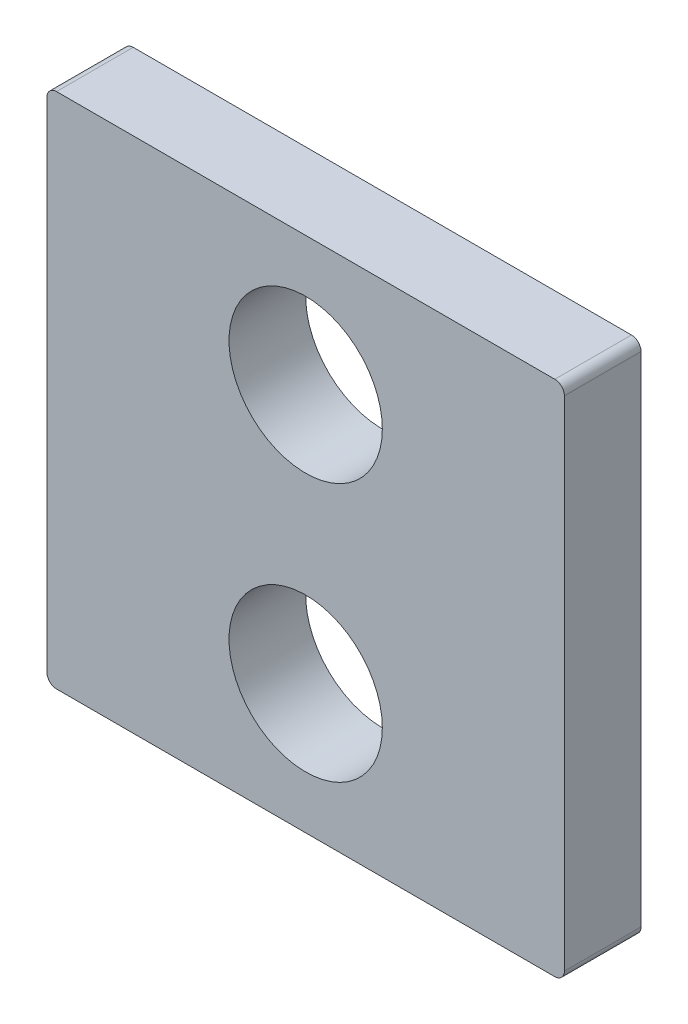
ISO-10303-21;
HEADER;
FILE_DESCRIPTION(('STEP AP214'),'2;1');
FILE_NAME('part.step','',(''),(''),'','','');
FILE_SCHEMA(('AUTOMOTIVE_DESIGN { 1 0 10303 214 1 1 1 1 }'));
ENDSEC;
DATA;
#1=APPLICATION_CONTEXT('core data for automotive mechanical design processes');
#2=APPLICATION_PROTOCOL_DEFINITION('international standard','automotive_design',2000,#1);
#3=PRODUCT_CONTEXT('',#1,'mechanical');
#4=PRODUCT('Part','Part','',(#3));
#5=PRODUCT_RELATED_PRODUCT_CATEGORY('part','',(#4));
#6=PRODUCT_DEFINITION_FORMATION('','',#4);
#7=PRODUCT_DEFINITION_CONTEXT('part definition',#1,'design');
#8=PRODUCT_DEFINITION('design','',#6,#7);
#9=PRODUCT_DEFINITION_SHAPE('','',#8);
#10=(LENGTH_UNIT() NAMED_UNIT(*) SI_UNIT(.MILLI.,.METRE.));
#11=(NAMED_UNIT(*) PLANE_ANGLE_UNIT() SI_UNIT($,.RADIAN.));
#12=(NAMED_UNIT(*) SI_UNIT($,.STERADIAN.) SOLID_ANGLE_UNIT());
#13=UNCERTAINTY_MEASURE_WITH_UNIT(LENGTH_MEASURE(1.E-05),#10,'distance_accuracy_value','');
#14=(GEOMETRIC_REPRESENTATION_CONTEXT(3) GLOBAL_UNCERTAINTY_ASSIGNED_CONTEXT((#13)) GLOBAL_UNIT_ASSIGNED_CONTEXT((#10,
#11,#12)) REPRESENTATION_CONTEXT('',''));
#15=CARTESIAN_POINT('',(0.,0.,0.));
#16=DIRECTION('',(0.,0.,1.));
#17=DIRECTION('',(1.,0.,0.));
#18=AXIS2_PLACEMENT_3D('',#15,#16,#17);
#19=CARTESIAN_POINT('',(151.652465963196,69.0432096796362,-12.700000000002));
#20=DIRECTION('',(0.,0.,1.00000000000001));
#21=DIRECTION('',(1.,0.,0.));
#22=AXIS2_PLACEMENT_3D('',#19,#20,#21);
#23=CYLINDRICAL_SURFACE('',#22,1.58750000000001);
#24=CARTESIAN_POINT('',(151.652465963196,69.0432096796366,-1.4432899320127E-12));
#25=DIRECTION('',(0.,0.,1.00000000000001));
#26=DIRECTION('',(1.,0.,0.));
#27=AXIS2_PLACEMENT_3D('',#24,#25,#26);
#28=CIRCLE('',#27,1.58750000000001);
#29=CARTESIAN_POINT('',(151.652465963196,70.6307096796363,-2.22044604925031E-13));
#30=VERTEX_POINT('',#29);
#31=CARTESIAN_POINT('',(150.064965963196,69.0432096796361,-1.0547118733939E-12));
#32=VERTEX_POINT('',#31);
#33=EDGE_CURVE('E230',#30,#32,#28,.T.);
#34=ORIENTED_EDGE('',*,*,#33,.F.);
#35=DIRECTION('',(0.,0.,1.00000000000001));
#36=VECTOR('',#35,1.);
#37=CARTESIAN_POINT('',(151.652465963196,70.6307096796364,-12.700000000001));
#38=LINE('',#37,#36);
#39=CARTESIAN_POINT('',(151.652465963196,70.6307096796364,-12.700000000001));
#40=VERTEX_POINT('',#39);
#41=EDGE_CURVE('E12',#40,#30,#38,.T.);
#42=ORIENTED_EDGE('',*,*,#41,.F.);
#43=CARTESIAN_POINT('',(151.652465963196,69.0432096796362,-12.700000000002));
#44=DIRECTION('',(0.,0.,1.00000000000001));
#45=DIRECTION('',(1.,0.,0.));
#46=AXIS2_PLACEMENT_3D('',#43,#44,#45);
#47=CIRCLE('',#46,1.58750000000001);
#48=CARTESIAN_POINT('',(150.064965963196,69.0432096796362,-12.7000000000018));
#49=VERTEX_POINT('',#48);
#50=EDGE_CURVE('E177',#40,#49,#47,.T.);
#51=ORIENTED_EDGE('',*,*,#50,.T.);
#52=DIRECTION('',(0.,0.,1.00000000000001));
#53=VECTOR('',#52,1.);
#54=CARTESIAN_POINT('',(150.064965963196,69.0432096796362,-12.7000000000018));
#55=LINE('',#54,#53);
#56=EDGE_CURVE('E46',#49,#32,#55,.T.);
#57=ORIENTED_EDGE('',*,*,#56,.T.);
#58=EDGE_LOOP('',(#34,#42,#51,#57));
#59=FACE_BOUND('',#58,.T.);
#60=ADVANCED_FACE('F43',(#59),#23,.T.);
#61=CARTESIAN_POINT('',(234.202465963196,70.6307096796363,-12.7000000000004));
#62=DIRECTION('',(0.,1.00000000000001,0.));
#63=DIRECTION('',(-1.,0.,0.));
#64=AXIS2_PLACEMENT_3D('',#61,#62,#63);
#65=PLANE('',#64);
#66=DIRECTION('',(-1.,0.,0.));
#67=VECTOR('',#66,1.);
#68=CARTESIAN_POINT('',(234.202465963196,70.6307096796358,-7.21644966006352E-13));
#69=LINE('',#68,#67);
#70=CARTESIAN_POINT('',(234.202465963196,70.6307096796358,-7.21644966006352E-13));
#71=VERTEX_POINT('',#70);
#72=EDGE_CURVE('E187',#71,#30,#69,.T.);
#73=ORIENTED_EDGE('',*,*,#72,.F.);
#74=DIRECTION('',(0.,0.,1.00000000000001));
#75=VECTOR('',#74,1.);
#76=CARTESIAN_POINT('',(234.202465963196,70.6307096796363,-12.7000000000004));
#77=LINE('',#76,#75);
#78=CARTESIAN_POINT('',(234.202465963196,70.6307096796363,-12.7000000000004));
#79=VERTEX_POINT('',#78);
#80=EDGE_CURVE('E54',#79,#71,#77,.T.);
#81=ORIENTED_EDGE('',*,*,#80,.F.);
#82=DIRECTION('',(-1.,0.,0.));
#83=VECTOR('',#82,1.);
#84=CARTESIAN_POINT('',(234.202465963196,70.6307096796363,-12.7000000000004));
#85=LINE('',#84,#83);
#86=EDGE_CURVE('E133',#79,#40,#85,.T.);
#87=ORIENTED_EDGE('',*,*,#86,.T.);
#88=ORIENTED_EDGE('',*,*,#41,.T.);
#89=EDGE_LOOP('',(#73,#81,#87,#88));
#90=FACE_BOUND('',#89,.T.);
#91=ADVANCED_FACE('F333',(#90),#65,.T.);
#92=CARTESIAN_POINT('',(234.202465963196,69.0432096796356,-12.7000000000009));
#93=DIRECTION('',(0.,0.,1.00000000000001));
#94=DIRECTION('',(1.,0.,0.));
#95=AXIS2_PLACEMENT_3D('',#92,#93,#94);
#96=CYLINDRICAL_SURFACE('',#95,1.58750000000001);
#97=CARTESIAN_POINT('',(234.202465963196,69.0432096796362,-9.43689570931383E-13));
#98=DIRECTION('',(0.,0.,1.00000000000001));
#99=DIRECTION('',(1.,0.,0.));
#100=AXIS2_PLACEMENT_3D('',#97,#98,#99);
#101=CIRCLE('',#100,1.58750000000001);
#102=CARTESIAN_POINT('',(235.789965963196,69.0432096796361,-1.27675647831893E-12));
#103=VERTEX_POINT('',#102);
#104=EDGE_CURVE('E119',#103,#71,#101,.T.);
#105=ORIENTED_EDGE('',*,*,#104,.F.);
#106=DIRECTION('',(0.,0.,1.00000000000001));
#107=VECTOR('',#106,1.);
#108=CARTESIAN_POINT('',(235.789965963196,69.043209679636,-12.7000000000004));
#109=LINE('',#108,#107);
#110=CARTESIAN_POINT('',(235.789965963196,69.043209679636,-12.7000000000004));
#111=VERTEX_POINT('',#110);
#112=EDGE_CURVE('E114',#111,#103,#109,.T.);
#113=ORIENTED_EDGE('',*,*,#112,.F.);
#114=CARTESIAN_POINT('',(234.202465963196,69.0432096796356,-12.7000000000009));
#115=DIRECTION('',(0.,0.,1.00000000000001));
#116=DIRECTION('',(1.,0.,0.));
#117=AXIS2_PLACEMENT_3D('',#114,#115,#116);
#118=CIRCLE('',#117,1.58750000000001);
#119=EDGE_CURVE('E117',#111,#79,#118,.T.);
#120=ORIENTED_EDGE('',*,*,#119,.T.);
#121=ORIENTED_EDGE('',*,*,#80,.T.);
#122=EDGE_LOOP('',(#105,#113,#120,#121));
#123=FACE_BOUND('',#122,.T.);
#124=ADVANCED_FACE('F116',(#123),#96,.T.);
#125=CARTESIAN_POINT('',(235.789965963196,-13.5067903203646,-12.700000000001));
#126=DIRECTION('',(1.,0.,0.));
#127=DIRECTION('',(0.,1.00000000000001,0.));
#128=AXIS2_PLACEMENT_3D('',#125,#126,#127);
#129=PLANE('',#128);
#130=DIRECTION('',(0.,1.00000000000001,0.));
#131=VECTOR('',#130,1.);
#132=CARTESIAN_POINT('',(235.789965963196,-13.5067903203639,-8.88178419700125E-13));
#133=LINE('',#132,#131);
#134=CARTESIAN_POINT('',(235.789965963196,-13.5067903203639,-8.88178419700125E-13));
#135=VERTEX_POINT('',#134);
#136=EDGE_CURVE('E201',#135,#103,#133,.T.);
#137=ORIENTED_EDGE('',*,*,#136,.F.);
#138=DIRECTION('',(0.,0.,1.00000000000001));
#139=VECTOR('',#138,1.);
#140=CARTESIAN_POINT('',(235.789965963196,-13.5067903203646,-12.700000000001));
#141=LINE('',#140,#139);
#142=CARTESIAN_POINT('',(235.789965963196,-13.5067903203646,-12.700000000001));
#143=VERTEX_POINT('',#142);
#144=EDGE_CURVE('E125',#143,#135,#141,.T.);
#145=ORIENTED_EDGE('',*,*,#144,.F.);
#146=DIRECTION('',(0.,1.00000000000001,0.));
#147=VECTOR('',#146,1.);
#148=CARTESIAN_POINT('',(235.789965963196,-13.5067903203646,-12.700000000001));
#149=LINE('',#148,#147);
#150=EDGE_CURVE('E131',#143,#111,#149,.T.);
#151=ORIENTED_EDGE('',*,*,#150,.T.);
#152=ORIENTED_EDGE('',*,*,#112,.T.);
#153=EDGE_LOOP('',(#137,#145,#151,#152));
#154=FACE_BOUND('',#153,.T.);
#155=ADVANCED_FACE('F136',(#154),#129,.T.);
#156=CARTESIAN_POINT('',(234.202465963196,-13.5067903203643,-12.7000000000012));
#157=DIRECTION('',(0.,0.,1.00000000000001));
#158=DIRECTION('',(1.,0.,0.));
#159=AXIS2_PLACEMENT_3D('',#156,#157,#158);
#160=CYLINDRICAL_SURFACE('',#159,1.5875);
#161=CARTESIAN_POINT('',(234.202465963196,-13.506790320364,-9.99200722162641E-13));
#162=DIRECTION('',(0.,0.,1.00000000000001));
#163=DIRECTION('',(1.,0.,0.));
#164=AXIS2_PLACEMENT_3D('',#161,#162,#163);
#165=CIRCLE('',#164,1.5875);
#166=CARTESIAN_POINT('',(234.202465963196,-15.0942903203641,0.));
#167=VERTEX_POINT('',#166);
#168=EDGE_CURVE('E204',#167,#135,#165,.T.);
#169=ORIENTED_EDGE('',*,*,#168,.F.);
#170=DIRECTION('',(0.,0.,1.00000000000001));
#171=VECTOR('',#170,1.);
#172=CARTESIAN_POINT('',(234.202465963196,-15.0942903203646,-12.7000000000012));
#173=LINE('',#172,#171);
#174=CARTESIAN_POINT('',(234.202465963196,-15.0942903203646,-12.7000000000012));
#175=VERTEX_POINT('',#174);
#176=EDGE_CURVE('E289',#175,#167,#173,.T.);
#177=ORIENTED_EDGE('',*,*,#176,.F.);
#178=CARTESIAN_POINT('',(234.202465963196,-13.5067903203643,-12.7000000000012));
#179=DIRECTION('',(0.,0.,1.00000000000001));
#180=DIRECTION('',(1.,0.,0.));
#181=AXIS2_PLACEMENT_3D('',#178,#179,#180);
#182=CIRCLE('',#181,1.5875);
#183=EDGE_CURVE('E138',#175,#143,#182,.T.);
#184=ORIENTED_EDGE('',*,*,#183,.T.);
#185=ORIENTED_EDGE('',*,*,#144,.T.);
#186=EDGE_LOOP('',(#169,#177,#184,#185));
#187=FACE_BOUND('',#186,.T.);
#188=ADVANCED_FACE('F332',(#187),#160,.T.);
#189=CARTESIAN_POINT('',(151.652465963196,-15.0942903203642,-12.7000000000011));
#190=DIRECTION('',(0.,-1.00000000000001,0.));
#191=DIRECTION('',(1.,0.,0.));
#192=AXIS2_PLACEMENT_3D('',#189,#190,#191);
#193=PLANE('',#192);
#194=DIRECTION('',(1.,0.,0.));
#195=VECTOR('',#194,1.);
#196=CARTESIAN_POINT('',(151.652465963196,-15.0942903203641,0.));
#197=LINE('',#196,#195);
#198=CARTESIAN_POINT('',(151.652465963196,-15.0942903203641,0.));
#199=VERTEX_POINT('',#198);
#200=EDGE_CURVE('E213',#199,#167,#197,.T.);
#201=ORIENTED_EDGE('',*,*,#200,.F.);
#202=DIRECTION('',(0.,0.,1.00000000000001));
#203=VECTOR('',#202,1.);
#204=CARTESIAN_POINT('',(151.652465963196,-15.0942903203642,-12.7000000000011));
#205=LINE('',#204,#203);
#206=CARTESIAN_POINT('',(151.652465963196,-15.0942903203642,-12.7000000000011));
#207=VERTEX_POINT('',#206);
#208=EDGE_CURVE('E293',#207,#199,#205,.T.);
#209=ORIENTED_EDGE('',*,*,#208,.F.);
#210=DIRECTION('',(1.,0.,0.));
#211=VECTOR('',#210,1.);
#212=CARTESIAN_POINT('',(151.652465963196,-15.0942903203642,-12.7000000000011));
#213=LINE('',#212,#211);
#214=EDGE_CURVE('E142',#207,#175,#213,.T.);
#215=ORIENTED_EDGE('',*,*,#214,.T.);
#216=ORIENTED_EDGE('',*,*,#176,.T.);
#217=EDGE_LOOP('',(#201,#209,#215,#216));
#218=FACE_BOUND('',#217,.T.);
#219=ADVANCED_FACE('F329',(#218),#193,.T.);
#220=CARTESIAN_POINT('',(151.652465963196,-13.5067903203646,-12.7000000000014));
#221=DIRECTION('',(0.,0.,1.00000000000001));
#222=DIRECTION('',(1.,0.,0.));
#223=AXIS2_PLACEMENT_3D('',#220,#221,#222);
#224=CYLINDRICAL_SURFACE('',#223,1.58750000000001);
#225=CARTESIAN_POINT('',(151.652465963196,-13.5067903203639,-8.88178419700125E-13));
#226=DIRECTION('',(0.,0.,1.00000000000001));
#227=DIRECTION('',(1.,0.,0.));
#228=AXIS2_PLACEMENT_3D('',#225,#226,#227);
#229=CIRCLE('',#228,1.58750000000001);
#230=CARTESIAN_POINT('',(150.064965963196,-13.5067903203644,-1.11022302462516E-12));
#231=VERTEX_POINT('',#230);
#232=EDGE_CURVE('E217',#231,#199,#229,.T.);
#233=ORIENTED_EDGE('',*,*,#232,.F.);
#234=DIRECTION('',(0.,0.,1.00000000000001));
#235=VECTOR('',#234,1.);
#236=CARTESIAN_POINT('',(150.064965963196,-13.5067903203646,-12.7000000000012));
#237=LINE('',#236,#235);
#238=CARTESIAN_POINT('',(150.064965963196,-13.5067903203646,-12.7000000000012));
#239=VERTEX_POINT('',#238);
#240=EDGE_CURVE('E297',#239,#231,#237,.T.);
#241=ORIENTED_EDGE('',*,*,#240,.F.);
#242=CARTESIAN_POINT('',(151.652465963196,-13.5067903203646,-12.7000000000014));
#243=DIRECTION('',(0.,0.,1.00000000000001));
#244=DIRECTION('',(1.,0.,0.));
#245=AXIS2_PLACEMENT_3D('',#242,#243,#244);
#246=CIRCLE('',#245,1.58750000000001);
#247=EDGE_CURVE('E164',#239,#207,#246,.T.);
#248=ORIENTED_EDGE('',*,*,#247,.T.);
#249=ORIENTED_EDGE('',*,*,#208,.T.);
#250=EDGE_LOOP('',(#233,#241,#248,#249));
#251=FACE_BOUND('',#250,.T.);
#252=ADVANCED_FACE('F325',(#251),#224,.T.);
#253=CARTESIAN_POINT('',(150.064965963196,69.0432096796362,-12.7000000000018));
#254=DIRECTION('',(-1.,0.,0.));
#255=DIRECTION('',(0.,0.,1.00000000000001));
#256=AXIS2_PLACEMENT_3D('',#253,#254,#255);
#257=PLANE('',#256);
#258=DIRECTION('',(0.,-1.00000000000001,0.));
#259=VECTOR('',#258,1.);
#260=CARTESIAN_POINT('',(150.064965963196,69.0432096796361,-1.0547118733939E-12));
#261=LINE('',#260,#259);
#262=EDGE_CURVE('E226',#32,#231,#261,.T.);
#263=ORIENTED_EDGE('',*,*,#262,.F.);
#264=ORIENTED_EDGE('',*,*,#56,.F.);
#265=DIRECTION('',(0.,-1.00000000000001,0.));
#266=VECTOR('',#265,1.);
#267=CARTESIAN_POINT('',(150.064965963196,69.0432096796362,-12.7000000000018));
#268=LINE('',#267,#266);
#269=EDGE_CURVE('E174',#49,#239,#268,.T.);
#270=ORIENTED_EDGE('',*,*,#269,.T.);
#271=ORIENTED_EDGE('',*,*,#240,.T.);
#272=EDGE_LOOP('',(#263,#264,#270,#271));
#273=FACE_BOUND('',#272,.T.);
#274=ADVANCED_FACE('F350',(#273),#257,.T.);
#275=CARTESIAN_POINT('',(151.652465963196,69.0432096796362,-12.700000000002));
#276=DIRECTION('',(0.,0.,1.00000000000001));
#277=DIRECTION('',(1.,0.,0.));
#278=AXIS2_PLACEMENT_3D('',#275,#276,#277);
#279=PLANE('',#278);
#280=CARTESIAN_POINT('',(192.927465963196,49.1994596796365,-12.7000000000011));
#281=DIRECTION('',(0.,0.,1.00000000000001));
#282=DIRECTION('',(1.,0.,0.));
#283=AXIS2_PLACEMENT_3D('',#280,#281,#282);
#284=CIRCLE('',#283,12.7);
#285=CARTESIAN_POINT('',(205.627465963196,49.1994596796365,-12.7000000000011));
#286=VERTEX_POINT('',#285);
#287=EDGE_CURVE('E249',#286,#286,#284,.T.);
#288=ORIENTED_EDGE('',*,*,#287,.T.);
#289=EDGE_LOOP('',(#288));
#290=FACE_BOUND('',#289,.T.);
#291=CARTESIAN_POINT('',(192.927465963196,6.33695967963549,-12.7000000000018));
#292=DIRECTION('',(0.,0.,1.00000000000001));
#293=DIRECTION('',(1.,0.,0.));
#294=AXIS2_PLACEMENT_3D('',#291,#292,#293);
#295=CIRCLE('',#294,12.7);
#296=CARTESIAN_POINT('',(205.627465963196,6.33695967963549,-12.7000000000018));
#297=VERTEX_POINT('',#296);
#298=EDGE_CURVE('E237',#297,#297,#295,.T.);
#299=ORIENTED_EDGE('',*,*,#298,.T.);
#300=EDGE_LOOP('',(#299));
#301=FACE_BOUND('',#300,.T.);
#302=ORIENTED_EDGE('',*,*,#50,.F.);
#303=ORIENTED_EDGE('',*,*,#86,.F.);
#304=ORIENTED_EDGE('',*,*,#119,.F.);
#305=ORIENTED_EDGE('',*,*,#150,.F.);
#306=ORIENTED_EDGE('',*,*,#183,.F.);
#307=ORIENTED_EDGE('',*,*,#214,.F.);
#308=ORIENTED_EDGE('',*,*,#247,.F.);
#309=ORIENTED_EDGE('',*,*,#269,.F.);
#310=EDGE_LOOP('',(#302,#303,#304,#305,#306,#307,#308,#309));
#311=FACE_BOUND('',#310,.T.);
#312=ADVANCED_FACE('F129',(#290,#301,#311),#279,.F.);
#313=CARTESIAN_POINT('',(151.652465963196,69.0432096796366,-1.4432899320127E-12));
#314=DIRECTION('',(0.,0.,1.00000000000001));
#315=DIRECTION('',(1.,0.,0.));
#316=AXIS2_PLACEMENT_3D('',#313,#314,#315);
#317=PLANE('',#316);
#318=CARTESIAN_POINT('',(192.927465963196,49.1994596796365,-7.7715611723761E-13));
#319=DIRECTION('',(0.,0.,1.00000000000001));
#320=DIRECTION('',(1.,0.,0.));
#321=AXIS2_PLACEMENT_3D('',#318,#319,#320);
#322=CIRCLE('',#321,12.7);
#323=CARTESIAN_POINT('',(205.627465963196,49.1994596796365,-7.78566100478884E-13));
#324=VERTEX_POINT('',#323);
#325=EDGE_CURVE('E253',#324,#324,#322,.T.);
#326=ORIENTED_EDGE('',*,*,#325,.F.);
#327=EDGE_LOOP('',(#326));
#328=FACE_BOUND('',#327,.T.);
#329=CARTESIAN_POINT('',(192.927465963196,6.33695967963568,-9.43689570931383E-13));
#330=DIRECTION('',(0.,0.,1.00000000000001));
#331=DIRECTION('',(1.,0.,0.));
#332=AXIS2_PLACEMENT_3D('',#329,#330,#331);
#333=CIRCLE('',#332,12.7);
#334=CARTESIAN_POINT('',(205.627465963196,6.33695967963568,-9.45099554172657E-13));
#335=VERTEX_POINT('',#334);
#336=EDGE_CURVE('E241',#335,#335,#333,.T.);
#337=ORIENTED_EDGE('',*,*,#336,.F.);
#338=EDGE_LOOP('',(#337));
#339=FACE_BOUND('',#338,.T.);
#340=ORIENTED_EDGE('',*,*,#33,.T.);
#341=ORIENTED_EDGE('',*,*,#262,.T.);
#342=ORIENTED_EDGE('',*,*,#232,.T.);
#343=ORIENTED_EDGE('',*,*,#200,.T.);
#344=ORIENTED_EDGE('',*,*,#168,.T.);
#345=ORIENTED_EDGE('',*,*,#136,.T.);
#346=ORIENTED_EDGE('',*,*,#104,.T.);
#347=ORIENTED_EDGE('',*,*,#72,.T.);
#348=EDGE_LOOP('',(#340,#341,#342,#343,#344,#345,#346,#347));
#349=FACE_BOUND('',#348,.T.);
#350=ADVANCED_FACE('F264',(#328,#339,#349),#317,.T.);
#351=CARTESIAN_POINT('',(192.927465963196,6.33695967963568,-9.43689570931383E-13));
#352=DIRECTION('',(0.,0.,1.00000000000001));
#353=DIRECTION('',(1.,0.,0.));
#354=AXIS2_PLACEMENT_3D('',#351,#352,#353);
#355=CYLINDRICAL_SURFACE('',#354,12.7);
#356=ORIENTED_EDGE('',*,*,#298,.F.);
#357=EDGE_LOOP('',(#356));
#358=FACE_BOUND('',#357,.T.);
#359=ORIENTED_EDGE('',*,*,#336,.T.);
#360=EDGE_LOOP('',(#359));
#361=FACE_BOUND('',#360,.T.);
#362=ADVANCED_FACE('F267',(#358,#361),#355,.F.);
#363=CARTESIAN_POINT('',(192.927465963196,49.1994596796365,-7.7715611723761E-13));
#364=DIRECTION('',(0.,0.,1.00000000000001));
#365=DIRECTION('',(1.,0.,0.));
#366=AXIS2_PLACEMENT_3D('',#363,#364,#365);
#367=CYLINDRICAL_SURFACE('',#366,12.7);
#368=ORIENTED_EDGE('',*,*,#287,.F.);
#369=EDGE_LOOP('',(#368));
#370=FACE_BOUND('',#369,.T.);
#371=ORIENTED_EDGE('',*,*,#325,.T.);
#372=EDGE_LOOP('',(#371));
#373=FACE_BOUND('',#372,.T.);
#374=ADVANCED_FACE('F262',(#370,#373),#367,.F.);
#375=CLOSED_SHELL('',(#60,#91,#124,#155,#188,#219,#252,#274,#312,#350,#362,#374));
#376=MANIFOLD_SOLID_BREP('B2',#375);
#377=ADVANCED_BREP_SHAPE_REPRESENTATION('',(#18,#376),#14);
#378=SHAPE_DEFINITION_REPRESENTATION(#9,#377);
ENDSEC;
END-ISO-10303-21;
